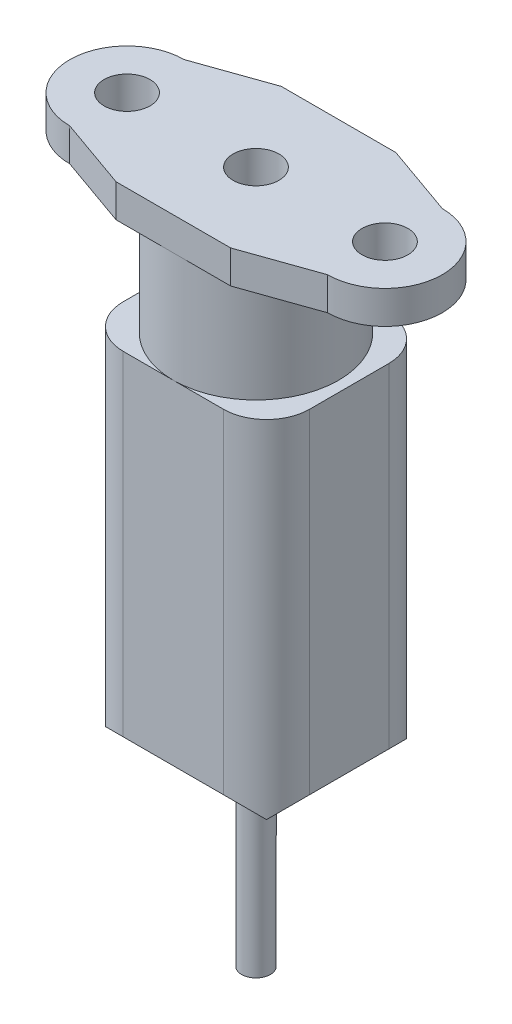
ISO-10303-21;
HEADER;
FILE_DESCRIPTION(('STEP AP214'),'2;1');
FILE_NAME('part.step','',(''),(''),'','','');
FILE_SCHEMA(('AUTOMOTIVE_DESIGN { 1 0 10303 214 1 1 1 1 }'));
ENDSEC;
DATA;
#1=APPLICATION_CONTEXT('core data for automotive mechanical design processes');
#2=APPLICATION_PROTOCOL_DEFINITION('international standard','automotive_design',2000,#1);
#3=PRODUCT_CONTEXT('',#1,'mechanical');
#4=PRODUCT('Part','Part','',(#3));
#5=PRODUCT_RELATED_PRODUCT_CATEGORY('part','',(#4));
#6=PRODUCT_DEFINITION_FORMATION('','',#4);
#7=PRODUCT_DEFINITION_CONTEXT('part definition',#1,'design');
#8=PRODUCT_DEFINITION('design','',#6,#7);
#9=PRODUCT_DEFINITION_SHAPE('','',#8);
#10=(LENGTH_UNIT() NAMED_UNIT(*) SI_UNIT(.MILLI.,.METRE.));
#11=(NAMED_UNIT(*) PLANE_ANGLE_UNIT() SI_UNIT($,.RADIAN.));
#12=(NAMED_UNIT(*) SI_UNIT($,.STERADIAN.) SOLID_ANGLE_UNIT());
#13=UNCERTAINTY_MEASURE_WITH_UNIT(LENGTH_MEASURE(1.E-05),#10,'distance_accuracy_value','');
#14=(GEOMETRIC_REPRESENTATION_CONTEXT(3) GLOBAL_UNCERTAINTY_ASSIGNED_CONTEXT((#13)) GLOBAL_UNIT_ASSIGNED_CONTEXT((#10,
#11,#12)) REPRESENTATION_CONTEXT('',''));
#15=CARTESIAN_POINT('',(0.,0.,0.));
#16=DIRECTION('',(0.,0.,1.));
#17=DIRECTION('',(1.,0.,0.));
#18=AXIS2_PLACEMENT_3D('',#15,#16,#17);
#19=CARTESIAN_POINT('',(-62.6999985985458,-2.3,-14.9999996647239));
#20=DIRECTION('',(0.,-1.,0.));
#21=DIRECTION('',(0.,0.,-1.));
#22=AXIS2_PLACEMENT_3D('',#19,#20,#21);
#23=PLANE('',#22);
#24=CARTESIAN_POINT('',(-71.6999985985458,-2.3,-14.9999996647239));
#25=DIRECTION('',(0.,-1.,0.));
#26=DIRECTION('',(0.,0.,-1.));
#27=AXIS2_PLACEMENT_3D('',#24,#25,#26);
#28=CIRCLE('',#27,5.765);
#29=CARTESIAN_POINT('',(-71.6999985985458,-2.3,-20.7649996647239));
#30=VERTEX_POINT('',#29);
#31=CARTESIAN_POINT('',(-71.6999985985458,-2.3,-9.23499966472387));
#32=VERTEX_POINT('',#31);
#33=EDGE_CURVE('E211',#30,#32,#28,.T.);
#34=ORIENTED_EDGE('',*,*,#33,.F.);
#35=DIRECTION('',(1.,0.,0.));
#36=VECTOR('',#35,1.);
#37=CARTESIAN_POINT('',(-75.6999985985458,-2.3,-20.7649996647239));
#38=LINE('',#37,#36);
#39=CARTESIAN_POINT('',(-67.6999985985458,-2.3,-20.7649996647239));
#40=VERTEX_POINT('',#39);
#41=EDGE_CURVE('E271',#30,#40,#38,.T.);
#42=ORIENTED_EDGE('',*,*,#41,.T.);
#43=DIRECTION('',(0.942972923561985,0.,0.332869442017381));
#44=VECTOR('',#43,1.);
#45=CARTESIAN_POINT('',(-67.6999985985458,-2.3,-20.7649996647239));
#46=LINE('',#45,#44);
#47=CARTESIAN_POINT('',(-62.6999985985458,-2.3,-18.9999996647239));
#48=VERTEX_POINT('',#47);
#49=EDGE_CURVE('E274',#40,#48,#46,.T.);
#50=ORIENTED_EDGE('',*,*,#49,.T.);
#51=CARTESIAN_POINT('',(-62.6999985985458,-2.3,-14.9999996647239));
#52=DIRECTION('',(0.,-1.,0.));
#53=DIRECTION('',(0.,0.,-1.));
#54=AXIS2_PLACEMENT_3D('',#51,#52,#53);
#55=CIRCLE('',#54,4.);
#56=CARTESIAN_POINT('',(-62.6999985985458,-2.3,-10.9999996647239));
#57=VERTEX_POINT('',#56);
#58=EDGE_CURVE('E277',#48,#57,#55,.T.);
#59=ORIENTED_EDGE('',*,*,#58,.T.);
#60=DIRECTION('',(-0.942972923561984,0.,0.332869442017384));
#61=VECTOR('',#60,1.);
#62=CARTESIAN_POINT('',(-62.6999985985458,-2.3,-10.9999996647239));
#63=LINE('',#62,#61);
#64=CARTESIAN_POINT('',(-67.6999985985458,-2.3,-9.23499966472388));
#65=VERTEX_POINT('',#64);
#66=EDGE_CURVE('E280',#57,#65,#63,.T.);
#67=ORIENTED_EDGE('',*,*,#66,.T.);
#68=DIRECTION('',(-1.,0.,0.));
#69=VECTOR('',#68,1.);
#70=CARTESIAN_POINT('',(-67.6999985985458,-2.3,-9.23499966472388));
#71=LINE('',#70,#69);
#72=EDGE_CURVE('E284',#65,#32,#71,.T.);
#73=ORIENTED_EDGE('',*,*,#72,.T.);
#74=EDGE_LOOP('',(#34,#42,#50,#59,#67,#73));
#75=FACE_BOUND('',#74,.T.);
#76=CARTESIAN_POINT('',(-62.6999985985458,-2.3,-14.9999996647239));
#77=DIRECTION('',(0.,-1.,0.));
#78=DIRECTION('',(0.,0.,1.));
#79=AXIS2_PLACEMENT_3D('',#76,#77,#78);
#80=CIRCLE('',#79,1.6);
#81=CARTESIAN_POINT('',(-62.6999985985458,-2.3,-13.3999996647239));
#82=VERTEX_POINT('',#81);
#83=EDGE_CURVE('E234',#82,#82,#80,.T.);
#84=ORIENTED_EDGE('',*,*,#83,.F.);
#85=EDGE_LOOP('',(#84));
#86=FACE_BOUND('',#85,.T.);
#87=ADVANCED_FACE('F33',(#75,#86),#23,.T.);
#88=CARTESIAN_POINT('',(-80.6999985985458,0.,-18.9999996647239));
#89=DIRECTION('',(-0.332869442017381,0.,-0.942972923561985));
#90=DIRECTION('',(-0.942972923561985,0.,0.332869442017381));
#91=AXIS2_PLACEMENT_3D('',#88,#89,#90);
#92=PLANE('',#91);
#93=DIRECTION('',(0.942972923561985,0.,-0.332869442017381));
#94=VECTOR('',#93,1.);
#95=CARTESIAN_POINT('',(-80.6999985985458,-2.3,-18.9999996647239));
#96=LINE('',#95,#94);
#97=CARTESIAN_POINT('',(-80.6999985985458,-2.3,-18.9999996647239));
#98=VERTEX_POINT('',#97);
#99=CARTESIAN_POINT('',(-75.6999985985458,-2.3,-20.7649996647239));
#100=VERTEX_POINT('',#99);
#101=EDGE_CURVE('E240',#98,#100,#96,.T.);
#102=ORIENTED_EDGE('',*,*,#101,.F.);
#103=DIRECTION('',(0.,-1.,0.));
#104=VECTOR('',#103,1.);
#105=CARTESIAN_POINT('',(-80.6999985985458,0.,-18.9999996647239));
#106=LINE('',#105,#104);
#107=CARTESIAN_POINT('',(-80.6999985985458,0.,-18.9999996647239));
#108=VERTEX_POINT('',#107);
#109=EDGE_CURVE('E292',#108,#98,#106,.T.);
#110=ORIENTED_EDGE('',*,*,#109,.F.);
#111=DIRECTION('',(0.942972923561985,0.,-0.332869442017381));
#112=VECTOR('',#111,1.);
#113=CARTESIAN_POINT('',(-80.6999985985458,0.,-18.9999996647239));
#114=LINE('',#113,#112);
#115=CARTESIAN_POINT('',(-75.6999985985458,0.,-20.7649996647239));
#116=VERTEX_POINT('',#115);
#117=EDGE_CURVE('E243',#108,#116,#114,.T.);
#118=ORIENTED_EDGE('',*,*,#117,.T.);
#119=DIRECTION('',(0.,-1.,0.));
#120=VECTOR('',#119,1.);
#121=CARTESIAN_POINT('',(-75.6999985985458,0.,-20.7649996647239));
#122=LINE('',#121,#120);
#123=EDGE_CURVE('E268',#116,#100,#122,.T.);
#124=ORIENTED_EDGE('',*,*,#123,.T.);
#125=EDGE_LOOP('',(#102,#110,#118,#124));
#126=FACE_BOUND('',#125,.T.);
#127=ADVANCED_FACE('F435',(#126),#92,.T.);
#128=CARTESIAN_POINT('',(-80.6999985985458,0.,-14.9999996647239));
#129=DIRECTION('',(0.,-1.,0.));
#130=DIRECTION('',(0.,0.,-1.));
#131=AXIS2_PLACEMENT_3D('',#128,#129,#130);
#132=CYLINDRICAL_SURFACE('',#131,4.00000000000001);
#133=CARTESIAN_POINT('',(-80.6999985985458,-2.3,-14.9999996647239));
#134=DIRECTION('',(0.,-1.,0.));
#135=DIRECTION('',(0.,0.,-1.));
#136=AXIS2_PLACEMENT_3D('',#133,#134,#135);
#137=CIRCLE('',#136,4.00000000000001);
#138=CARTESIAN_POINT('',(-80.6999985985458,-2.3,-10.9999996647239));
#139=VERTEX_POINT('',#138);
#140=EDGE_CURVE('E247',#139,#98,#137,.T.);
#141=ORIENTED_EDGE('',*,*,#140,.F.);
#142=DIRECTION('',(0.,-1.,0.));
#143=VECTOR('',#142,1.);
#144=CARTESIAN_POINT('',(-80.6999985985458,0.,-10.9999996647239));
#145=LINE('',#144,#143);
#146=CARTESIAN_POINT('',(-80.6999985985458,0.,-10.9999996647239));
#147=VERTEX_POINT('',#146);
#148=EDGE_CURVE('E294',#147,#139,#145,.T.);
#149=ORIENTED_EDGE('',*,*,#148,.F.);
#150=CARTESIAN_POINT('',(-80.6999985985458,0.,-14.9999996647239));
#151=DIRECTION('',(0.,-1.,0.));
#152=DIRECTION('',(0.,0.,-1.));
#153=AXIS2_PLACEMENT_3D('',#150,#151,#152);
#154=CIRCLE('',#153,4.00000000000001);
#155=EDGE_CURVE('E265',#147,#108,#154,.T.);
#156=ORIENTED_EDGE('',*,*,#155,.T.);
#157=ORIENTED_EDGE('',*,*,#109,.T.);
#158=EDGE_LOOP('',(#141,#149,#156,#157));
#159=FACE_BOUND('',#158,.T.);
#160=ADVANCED_FACE('F442',(#159),#132,.T.);
#161=CARTESIAN_POINT('',(-75.6999985985458,0.,-9.23499966472387));
#162=DIRECTION('',(-0.332869442017383,0.,0.942972923561984));
#163=DIRECTION('',(0.942972923561984,0.,0.332869442017383));
#164=AXIS2_PLACEMENT_3D('',#161,#162,#163);
#165=PLANE('',#164);
#166=DIRECTION('',(-0.942972923561984,0.,-0.332869442017383));
#167=VECTOR('',#166,1.);
#168=CARTESIAN_POINT('',(-75.6999985985458,-2.3,-9.23499966472387));
#169=LINE('',#168,#167);
#170=CARTESIAN_POINT('',(-75.6999985985458,-2.3,-9.23499966472387));
#171=VERTEX_POINT('',#170);
#172=EDGE_CURVE('E287',#171,#139,#169,.T.);
#173=ORIENTED_EDGE('',*,*,#172,.F.);
#174=DIRECTION('',(0.,-1.,0.));
#175=VECTOR('',#174,1.);
#176=CARTESIAN_POINT('',(-75.6999985985458,0.,-9.23499966472387));
#177=LINE('',#176,#175);
#178=CARTESIAN_POINT('',(-75.6999985985458,0.,-9.23499966472387));
#179=VERTEX_POINT('',#178);
#180=EDGE_CURVE('E296',#179,#171,#177,.T.);
#181=ORIENTED_EDGE('',*,*,#180,.F.);
#182=DIRECTION('',(-0.942972923561984,0.,-0.332869442017383));
#183=VECTOR('',#182,1.);
#184=CARTESIAN_POINT('',(-75.6999985985458,0.,-9.23499966472387));
#185=LINE('',#184,#183);
#186=EDGE_CURVE('E262',#179,#147,#185,.T.);
#187=ORIENTED_EDGE('',*,*,#186,.T.);
#188=ORIENTED_EDGE('',*,*,#148,.T.);
#189=EDGE_LOOP('',(#173,#181,#187,#188));
#190=FACE_BOUND('',#189,.T.);
#191=ADVANCED_FACE('F633',(#190),#165,.T.);
#192=CARTESIAN_POINT('',(-67.6999985985458,0.,-9.23499966472388));
#193=DIRECTION('',(0.,0.,1.));
#194=DIRECTION('',(1.,0.,0.));
#195=AXIS2_PLACEMENT_3D('',#192,#193,#194);
#196=PLANE('',#195);
#197=ORIENTED_EDGE('',*,*,#72,.F.);
#198=DIRECTION('',(0.,-1.,0.));
#199=VECTOR('',#198,1.);
#200=CARTESIAN_POINT('',(-67.6999985985458,0.,-9.23499966472388));
#201=LINE('',#200,#199);
#202=CARTESIAN_POINT('',(-67.6999985985458,0.,-9.23499966472388));
#203=VERTEX_POINT('',#202);
#204=EDGE_CURVE('E299',#203,#65,#201,.T.);
#205=ORIENTED_EDGE('',*,*,#204,.F.);
#206=DIRECTION('',(-1.,0.,0.));
#207=VECTOR('',#206,1.);
#208=CARTESIAN_POINT('',(-67.6999985985458,0.,-9.23499966472388));
#209=LINE('',#208,#207);
#210=EDGE_CURVE('E259',#203,#179,#209,.T.);
#211=ORIENTED_EDGE('',*,*,#210,.T.);
#212=ORIENTED_EDGE('',*,*,#180,.T.);
#213=EDGE_CURVE('E283',#32,#171,#71,.T.);
#214=ORIENTED_EDGE('',*,*,#213,.F.);
#215=EDGE_LOOP('',(#197,#205,#211,#212,#214));
#216=FACE_BOUND('',#215,.T.);
#217=ADVANCED_FACE('F629',(#216),#196,.T.);
#218=CARTESIAN_POINT('',(-62.6999985985458,0.,-10.9999996647239));
#219=DIRECTION('',(0.332869442017384,0.,0.942972923561984));
#220=DIRECTION('',(0.942972923561984,0.,-0.332869442017384));
#221=AXIS2_PLACEMENT_3D('',#218,#219,#220);
#222=PLANE('',#221);
#223=ORIENTED_EDGE('',*,*,#66,.F.);
#224=DIRECTION('',(0.,-1.,0.));
#225=VECTOR('',#224,1.);
#226=CARTESIAN_POINT('',(-62.6999985985458,0.,-10.9999996647239));
#227=LINE('',#226,#225);
#228=CARTESIAN_POINT('',(-62.6999985985458,0.,-10.9999996647239));
#229=VERTEX_POINT('',#228);
#230=EDGE_CURVE('E301',#229,#57,#227,.T.);
#231=ORIENTED_EDGE('',*,*,#230,.F.);
#232=DIRECTION('',(-0.942972923561984,0.,0.332869442017384));
#233=VECTOR('',#232,1.);
#234=CARTESIAN_POINT('',(-62.6999985985458,0.,-10.9999996647239));
#235=LINE('',#234,#233);
#236=EDGE_CURVE('E256',#229,#203,#235,.T.);
#237=ORIENTED_EDGE('',*,*,#236,.T.);
#238=ORIENTED_EDGE('',*,*,#204,.T.);
#239=EDGE_LOOP('',(#223,#231,#237,#238));
#240=FACE_BOUND('',#239,.T.);
#241=ADVANCED_FACE('F625',(#240),#222,.T.);
#242=CARTESIAN_POINT('',(-62.6999985985458,0.,-14.9999996647239));
#243=DIRECTION('',(0.,-1.,0.));
#244=DIRECTION('',(0.,0.,-1.));
#245=AXIS2_PLACEMENT_3D('',#242,#243,#244);
#246=CYLINDRICAL_SURFACE('',#245,4.);
#247=ORIENTED_EDGE('',*,*,#58,.F.);
#248=DIRECTION('',(0.,-1.,0.));
#249=VECTOR('',#248,1.);
#250=CARTESIAN_POINT('',(-62.6999985985458,0.,-18.9999996647239));
#251=LINE('',#250,#249);
#252=CARTESIAN_POINT('',(-62.6999985985458,0.,-18.9999996647239));
#253=VERTEX_POINT('',#252);
#254=EDGE_CURVE('E303',#253,#48,#251,.T.);
#255=ORIENTED_EDGE('',*,*,#254,.F.);
#256=CARTESIAN_POINT('',(-62.6999985985458,0.,-14.9999996647239));
#257=DIRECTION('',(0.,-1.,0.));
#258=DIRECTION('',(0.,0.,-1.));
#259=AXIS2_PLACEMENT_3D('',#256,#257,#258);
#260=CIRCLE('',#259,4.);
#261=EDGE_CURVE('E253',#253,#229,#260,.T.);
#262=ORIENTED_EDGE('',*,*,#261,.T.);
#263=ORIENTED_EDGE('',*,*,#230,.T.);
#264=EDGE_LOOP('',(#247,#255,#262,#263));
#265=FACE_BOUND('',#264,.T.);
#266=ADVANCED_FACE('F621',(#265),#246,.T.);
#267=CARTESIAN_POINT('',(-67.6999985985458,0.,-20.7649996647239));
#268=DIRECTION('',(0.332869442017381,0.,-0.942972923561985));
#269=DIRECTION('',(-0.942972923561985,0.,-0.332869442017381));
#270=AXIS2_PLACEMENT_3D('',#267,#268,#269);
#271=PLANE('',#270);
#272=ORIENTED_EDGE('',*,*,#49,.F.);
#273=DIRECTION('',(0.,-1.,0.));
#274=VECTOR('',#273,1.);
#275=CARTESIAN_POINT('',(-67.6999985985458,0.,-20.7649996647239));
#276=LINE('',#275,#274);
#277=CARTESIAN_POINT('',(-67.6999985985458,0.,-20.7649996647239));
#278=VERTEX_POINT('',#277);
#279=EDGE_CURVE('E305',#278,#40,#276,.T.);
#280=ORIENTED_EDGE('',*,*,#279,.F.);
#281=DIRECTION('',(0.942972923561985,0.,0.332869442017381));
#282=VECTOR('',#281,1.);
#283=CARTESIAN_POINT('',(-67.6999985985458,0.,-20.7649996647239));
#284=LINE('',#283,#282);
#285=EDGE_CURVE('E250',#278,#253,#284,.T.);
#286=ORIENTED_EDGE('',*,*,#285,.T.);
#287=ORIENTED_EDGE('',*,*,#254,.T.);
#288=EDGE_LOOP('',(#272,#280,#286,#287));
#289=FACE_BOUND('',#288,.T.);
#290=ADVANCED_FACE('F617',(#289),#271,.T.);
#291=CARTESIAN_POINT('',(-75.6999985985458,0.,-20.7649996647239));
#292=DIRECTION('',(0.,0.,-1.));
#293=DIRECTION('',(-1.,0.,0.));
#294=AXIS2_PLACEMENT_3D('',#291,#292,#293);
#295=PLANE('',#294);
#296=EDGE_CURVE('E272',#100,#30,#38,.T.);
#297=ORIENTED_EDGE('',*,*,#296,.F.);
#298=ORIENTED_EDGE('',*,*,#123,.F.);
#299=DIRECTION('',(1.,0.,0.));
#300=VECTOR('',#299,1.);
#301=CARTESIAN_POINT('',(-75.6999985985458,0.,-20.7649996647239));
#302=LINE('',#301,#300);
#303=EDGE_CURVE('E246',#116,#278,#302,.T.);
#304=ORIENTED_EDGE('',*,*,#303,.T.);
#305=ORIENTED_EDGE('',*,*,#279,.T.);
#306=ORIENTED_EDGE('',*,*,#41,.F.);
#307=EDGE_LOOP('',(#297,#298,#304,#305,#306));
#308=FACE_BOUND('',#307,.T.);
#309=ADVANCED_FACE('F460',(#308),#295,.T.);
#310=CARTESIAN_POINT('',(-62.6999985985458,0.,-14.9999996647239));
#311=DIRECTION('',(0.,-1.,0.));
#312=DIRECTION('',(0.,0.,-1.));
#313=AXIS2_PLACEMENT_3D('',#310,#311,#312);
#314=PLANE('',#313);
#315=CARTESIAN_POINT('',(-80.6999985985458,0.,-14.9999996647239));
#316=DIRECTION('',(0.,-1.,0.));
#317=DIRECTION('',(0.,0.,1.));
#318=AXIS2_PLACEMENT_3D('',#315,#316,#317);
#319=CIRCLE('',#318,1.6);
#320=CARTESIAN_POINT('',(-80.6999985985458,0.,-13.3999996647239));
#321=VERTEX_POINT('',#320);
#322=EDGE_CURVE('E225',#321,#321,#319,.T.);
#323=ORIENTED_EDGE('',*,*,#322,.T.);
#324=EDGE_LOOP('',(#323));
#325=FACE_BOUND('',#324,.T.);
#326=CARTESIAN_POINT('',(-71.6999985985458,0.,-14.9999996647239));
#327=DIRECTION('',(0.,-1.,0.));
#328=DIRECTION('',(0.,0.,1.));
#329=AXIS2_PLACEMENT_3D('',#326,#327,#328);
#330=CIRCLE('',#329,1.6);
#331=CARTESIAN_POINT('',(-71.6999985985458,0.,-13.3999996647239));
#332=VERTEX_POINT('',#331);
#333=EDGE_CURVE('E228',#332,#332,#330,.T.);
#334=ORIENTED_EDGE('',*,*,#333,.T.);
#335=EDGE_LOOP('',(#334));
#336=FACE_BOUND('',#335,.T.);
#337=CARTESIAN_POINT('',(-62.6999985985458,0.,-14.9999996647239));
#338=DIRECTION('',(0.,-1.,0.));
#339=DIRECTION('',(0.,0.,1.));
#340=AXIS2_PLACEMENT_3D('',#337,#338,#339);
#341=CIRCLE('',#340,1.6);
#342=CARTESIAN_POINT('',(-62.6999985985458,0.,-13.3999996647239));
#343=VERTEX_POINT('',#342);
#344=EDGE_CURVE('E237',#343,#343,#341,.T.);
#345=ORIENTED_EDGE('',*,*,#344,.T.);
#346=EDGE_LOOP('',(#345));
#347=FACE_BOUND('',#346,.T.);
#348=ORIENTED_EDGE('',*,*,#117,.F.);
#349=ORIENTED_EDGE('',*,*,#155,.F.);
#350=ORIENTED_EDGE('',*,*,#186,.F.);
#351=ORIENTED_EDGE('',*,*,#210,.F.);
#352=ORIENTED_EDGE('',*,*,#236,.F.);
#353=ORIENTED_EDGE('',*,*,#261,.F.);
#354=ORIENTED_EDGE('',*,*,#285,.F.);
#355=ORIENTED_EDGE('',*,*,#303,.F.);
#356=EDGE_LOOP('',(#348,#349,#350,#351,#352,#353,#354,#355));
#357=FACE_BOUND('',#356,.T.);
#358=ADVANCED_FACE('F451',(#325,#336,#347,#357),#314,.F.);
#359=EDGE_CURVE('E224',#32,#30,#28,.T.);
#360=ORIENTED_EDGE('',*,*,#359,.F.);
#361=ORIENTED_EDGE('',*,*,#213,.T.);
#362=ORIENTED_EDGE('',*,*,#172,.T.);
#363=ORIENTED_EDGE('',*,*,#140,.T.);
#364=ORIENTED_EDGE('',*,*,#101,.T.);
#365=ORIENTED_EDGE('',*,*,#296,.T.);
#366=EDGE_LOOP('',(#360,#361,#362,#363,#364,#365));
#367=FACE_BOUND('',#366,.T.);
#368=CARTESIAN_POINT('',(-80.6999985985458,-2.3,-14.9999996647239));
#369=DIRECTION('',(0.,-1.,0.));
#370=DIRECTION('',(0.,0.,1.));
#371=AXIS2_PLACEMENT_3D('',#368,#369,#370);
#372=CIRCLE('',#371,1.6);
#373=CARTESIAN_POINT('',(-80.6999985985458,-2.3,-13.3999996647239));
#374=VERTEX_POINT('',#373);
#375=EDGE_CURVE('E229',#374,#374,#372,.T.);
#376=ORIENTED_EDGE('',*,*,#375,.F.);
#377=EDGE_LOOP('',(#376));
#378=FACE_BOUND('',#377,.T.);
#379=ADVANCED_FACE('F438',(#367,#378),#23,.T.);
#380=CARTESIAN_POINT('',(-62.6999985985458,0.,-14.9999996647239));
#381=DIRECTION('',(0.,-1.,0.));
#382=DIRECTION('',(0.,0.,-1.));
#383=AXIS2_PLACEMENT_3D('',#380,#381,#382);
#384=CYLINDRICAL_SURFACE('',#383,1.6);
#385=ORIENTED_EDGE('',*,*,#344,.F.);
#386=EDGE_LOOP('',(#385));
#387=FACE_BOUND('',#386,.T.);
#388=ORIENTED_EDGE('',*,*,#83,.T.);
#389=EDGE_LOOP('',(#388));
#390=FACE_BOUND('',#389,.T.);
#391=ADVANCED_FACE('F450',(#387,#390),#384,.F.);
#392=CARTESIAN_POINT('',(-71.6999985985458,0.,-14.9999996647239));
#393=DIRECTION('',(0.,-1.,0.));
#394=DIRECTION('',(0.,0.,-1.));
#395=AXIS2_PLACEMENT_3D('',#392,#393,#394);
#396=CYLINDRICAL_SURFACE('',#395,1.6);
#397=ORIENTED_EDGE('',*,*,#333,.F.);
#398=EDGE_LOOP('',(#397));
#399=FACE_BOUND('',#398,.T.);
#400=CARTESIAN_POINT('',(-71.6999985985458,-2.3,-14.9999996647239));
#401=DIRECTION('',(0.,-1.,0.));
#402=DIRECTION('',(0.,0.,1.));
#403=AXIS2_PLACEMENT_3D('',#400,#401,#402);
#404=CIRCLE('',#403,1.6);
#405=CARTESIAN_POINT('',(-71.6999985985458,-2.3,-13.3999996647239));
#406=VERTEX_POINT('',#405);
#407=EDGE_CURVE('E206',#406,#406,#404,.T.);
#408=ORIENTED_EDGE('',*,*,#407,.T.);
#409=EDGE_LOOP('',(#408));
#410=FACE_BOUND('',#409,.T.);
#411=ADVANCED_FACE('F457',(#399,#410),#396,.F.);
#412=CARTESIAN_POINT('',(-80.6999985985458,0.,-14.9999996647239));
#413=DIRECTION('',(0.,-1.,0.));
#414=DIRECTION('',(0.,0.,-1.));
#415=AXIS2_PLACEMENT_3D('',#412,#413,#414);
#416=CYLINDRICAL_SURFACE('',#415,1.6);
#417=ORIENTED_EDGE('',*,*,#322,.F.);
#418=EDGE_LOOP('',(#417));
#419=FACE_BOUND('',#418,.T.);
#420=ORIENTED_EDGE('',*,*,#375,.T.);
#421=EDGE_LOOP('',(#420));
#422=FACE_BOUND('',#421,.T.);
#423=ADVANCED_FACE('F467',(#419,#422),#416,.F.);
#424=CARTESIAN_POINT('',(-71.6999985985458,-10.,-14.9999996647239));
#425=DIRECTION('',(0.,1.,0.));
#426=DIRECTION('',(0.,0.,1.));
#427=AXIS2_PLACEMENT_3D('',#424,#425,#426);
#428=CYLINDRICAL_SURFACE('',#427,5.765);
#429=CARTESIAN_POINT('',(-71.6999985985458,-10.,-14.9999996647239));
#430=DIRECTION('',(0.,-1.,0.));
#431=DIRECTION('',(0.,0.,-1.));
#432=AXIS2_PLACEMENT_3D('',#429,#430,#431);
#433=CIRCLE('',#432,5.765);
#434=CARTESIAN_POINT('',(-71.6999985985458,-10.,-20.7649996647239));
#435=VERTEX_POINT('',#434);
#436=CARTESIAN_POINT('',(-71.6999985985458,-10.,-9.23499966472387));
#437=VERTEX_POINT('',#436);
#438=EDGE_CURVE('E199',#435,#437,#433,.T.);
#439=ORIENTED_EDGE('',*,*,#438,.F.);
#440=EDGE_CURVE('E202',#437,#435,#433,.T.);
#441=ORIENTED_EDGE('',*,*,#440,.F.);
#442=EDGE_LOOP('',(#439,#441));
#443=FACE_BOUND('',#442,.T.);
#444=ORIENTED_EDGE('',*,*,#33,.T.);
#445=ORIENTED_EDGE('',*,*,#359,.T.);
#446=EDGE_LOOP('',(#444,#445));
#447=FACE_BOUND('',#446,.T.);
#448=ADVANCED_FACE('F200',(#443,#447),#428,.T.);
#449=CARTESIAN_POINT('',(-71.6999985985458,-2.3,-14.9999996647239));
#450=DIRECTION('',(0.,-1.,0.));
#451=DIRECTION('',(0.,0.,-1.));
#452=AXIS2_PLACEMENT_3D('',#449,#450,#451);
#453=PLANE('',#452);
#454=ORIENTED_EDGE('',*,*,#407,.F.);
#455=EDGE_LOOP('',(#454));
#456=FACE_BOUND('',#455,.T.);
#457=ADVANCED_FACE('F475',(#456),#453,.F.);
#458=CARTESIAN_POINT('',(0.,-10.,0.));
#459=DIRECTION('',(0.,1.,0.));
#460=DIRECTION('',(0.,0.,1.));
#461=AXIS2_PLACEMENT_3D('',#458,#459,#460);
#462=PLANE('',#461);
#463=DIRECTION('',(-1.,0.,0.));
#464=VECTOR('',#463,1.);
#465=CARTESIAN_POINT('',(-78.1999985985458,-10.,-9.23499966472387));
#466=LINE('',#465,#464);
#467=CARTESIAN_POINT('',(-68.1999985985458,-10.,-9.23499966472387));
#468=VERTEX_POINT('',#467);
#469=EDGE_CURVE('E217',#468,#437,#466,.T.);
#470=ORIENTED_EDGE('',*,*,#469,.F.);
#471=CARTESIAN_POINT('',(-68.1999985985458,-10.,-12.2349996647239));
#472=DIRECTION('',(0.,1.,0.));
#473=DIRECTION('',(0.,0.,1.));
#474=AXIS2_PLACEMENT_3D('',#471,#472,#473);
#475=CIRCLE('',#474,3.);
#476=CARTESIAN_POINT('',(-65.1999985985458,-10.,-12.2349996647239));
#477=VERTEX_POINT('',#476);
#478=EDGE_CURVE('E373',#468,#477,#475,.T.);
#479=ORIENTED_EDGE('',*,*,#478,.T.);
#480=DIRECTION('',(0.,0.,1.));
#481=VECTOR('',#480,1.);
#482=CARTESIAN_POINT('',(-65.1999985985458,-10.,-9.23499966472387));
#483=LINE('',#482,#481);
#484=CARTESIAN_POINT('',(-65.1999985985458,-10.,-17.7649996647239));
#485=VERTEX_POINT('',#484);
#486=EDGE_CURVE('E194',#485,#477,#483,.T.);
#487=ORIENTED_EDGE('',*,*,#486,.F.);
#488=CARTESIAN_POINT('',(-68.1999985985458,-10.,-17.7649996647239));
#489=DIRECTION('',(0.,1.,0.));
#490=DIRECTION('',(0.,0.,1.));
#491=AXIS2_PLACEMENT_3D('',#488,#489,#490);
#492=CIRCLE('',#491,3.);
#493=CARTESIAN_POINT('',(-68.1999985985458,-10.,-20.7649996647239));
#494=VERTEX_POINT('',#493);
#495=EDGE_CURVE('E214',#485,#494,#492,.T.);
#496=ORIENTED_EDGE('',*,*,#495,.T.);
#497=DIRECTION('',(1.,0.,0.));
#498=VECTOR('',#497,1.);
#499=CARTESIAN_POINT('',(-65.1999985985458,-10.,-20.7649996647239));
#500=LINE('',#499,#498);
#501=EDGE_CURVE('E188',#435,#494,#500,.T.);
#502=ORIENTED_EDGE('',*,*,#501,.F.);
#503=ORIENTED_EDGE('',*,*,#438,.T.);
#504=EDGE_LOOP('',(#470,#479,#487,#496,#502,#503));
#505=FACE_BOUND('',#504,.T.);
#506=ADVANCED_FACE('F212',(#505),#462,.T.);
#507=CARTESIAN_POINT('',(-78.1999985985458,-36.3,-9.23499966472387));
#508=DIRECTION('',(0.,0.,-1.));
#509=DIRECTION('',(-1.,0.,0.));
#510=AXIS2_PLACEMENT_3D('',#507,#508,#509);
#511=PLANE('',#510);
#512=CARTESIAN_POINT('',(-75.1999985985458,-10.,-9.23499966472387));
#513=VERTEX_POINT('',#512);
#514=EDGE_CURVE('E210',#437,#513,#466,.T.);
#515=ORIENTED_EDGE('',*,*,#514,.T.);
#516=DIRECTION('',(0.,1.,0.));
#517=VECTOR('',#516,1.);
#518=CARTESIAN_POINT('',(-75.1999985985458,-36.3,-9.23499966472387));
#519=LINE('',#518,#517);
#520=CARTESIAN_POINT('',(-75.1999985985458,-33.3,-9.23499966472387));
#521=VERTEX_POINT('',#520);
#522=EDGE_CURVE('E366',#513,#521,#519,.F.);
#523=ORIENTED_EDGE('',*,*,#522,.T.);
#524=DIRECTION('',(1.,0.,0.));
#525=VECTOR('',#524,1.);
#526=CARTESIAN_POINT('',(-78.1999985985458,-33.3,-9.23499966472387));
#527=LINE('',#526,#525);
#528=CARTESIAN_POINT('',(-68.1999985985458,-33.3,-9.23499966472387));
#529=VERTEX_POINT('',#528);
#530=EDGE_CURVE('E325',#521,#529,#527,.T.);
#531=ORIENTED_EDGE('',*,*,#530,.T.);
#532=DIRECTION('',(0.,1.,0.));
#533=VECTOR('',#532,1.);
#534=CARTESIAN_POINT('',(-68.1999985985458,-36.3,-9.23499966472387));
#535=LINE('',#534,#533);
#536=EDGE_CURVE('E363',#529,#468,#535,.T.);
#537=ORIENTED_EDGE('',*,*,#536,.T.);
#538=ORIENTED_EDGE('',*,*,#469,.T.);
#539=EDGE_LOOP('',(#515,#523,#531,#537,#538));
#540=FACE_BOUND('',#539,.T.);
#541=ADVANCED_FACE('F387',(#540),#511,.F.);
#542=CARTESIAN_POINT('',(-78.1999985985458,-36.3,-20.7649996647239));
#543=DIRECTION('',(1.,0.,0.));
#544=DIRECTION('',(0.,0.,-1.));
#545=AXIS2_PLACEMENT_3D('',#542,#543,#544);
#546=PLANE('',#545);
#547=DIRECTION('',(0.,0.,-1.));
#548=VECTOR('',#547,1.);
#549=CARTESIAN_POINT('',(-78.1999985985458,-10.,-20.7649996647239));
#550=LINE('',#549,#548);
#551=CARTESIAN_POINT('',(-78.1999985985458,-10.,-12.2349996647239));
#552=VERTEX_POINT('',#551);
#553=CARTESIAN_POINT('',(-78.1999985985458,-10.,-17.7649996647239));
#554=VERTEX_POINT('',#553);
#555=EDGE_CURVE('E215',#552,#554,#550,.T.);
#556=ORIENTED_EDGE('',*,*,#555,.T.);
#557=DIRECTION('',(0.,1.,0.));
#558=VECTOR('',#557,1.);
#559=CARTESIAN_POINT('',(-78.1999985985458,-36.3,-17.7649996647239));
#560=LINE('',#559,#558);
#561=CARTESIAN_POINT('',(-78.1999985985458,-33.3,-17.7649996647239));
#562=VERTEX_POINT('',#561);
#563=EDGE_CURVE('E353',#554,#562,#560,.F.);
#564=ORIENTED_EDGE('',*,*,#563,.T.);
#565=DIRECTION('',(0.,0.,1.));
#566=VECTOR('',#565,1.);
#567=CARTESIAN_POINT('',(-78.1999985985458,-33.3,-20.7649996647239));
#568=LINE('',#567,#566);
#569=CARTESIAN_POINT('',(-78.1999985985458,-33.3,-12.2349996647239));
#570=VERTEX_POINT('',#569);
#571=EDGE_CURVE('E322',#562,#570,#568,.T.);
#572=ORIENTED_EDGE('',*,*,#571,.T.);
#573=DIRECTION('',(0.,1.,0.));
#574=VECTOR('',#573,1.);
#575=CARTESIAN_POINT('',(-78.1999985985458,-36.3,-12.2349996647239));
#576=LINE('',#575,#574);
#577=EDGE_CURVE('E350',#570,#552,#576,.T.);
#578=ORIENTED_EDGE('',*,*,#577,.T.);
#579=EDGE_LOOP('',(#556,#564,#572,#578));
#580=FACE_BOUND('',#579,.T.);
#581=ADVANCED_FACE('F404',(#580),#546,.F.);
#582=CARTESIAN_POINT('',(-65.1999985985458,-36.3,-20.7649996647239));
#583=DIRECTION('',(0.,0.,1.));
#584=DIRECTION('',(1.,0.,0.));
#585=AXIS2_PLACEMENT_3D('',#582,#583,#584);
#586=PLANE('',#585);
#587=DIRECTION('',(-1.,0.,0.));
#588=VECTOR('',#587,1.);
#589=CARTESIAN_POINT('',(-65.1999985985458,-33.3,-20.7649996647239));
#590=LINE('',#589,#588);
#591=CARTESIAN_POINT('',(-68.1999985985458,-33.3,-20.7649996647239));
#592=VERTEX_POINT('',#591);
#593=CARTESIAN_POINT('',(-75.1999985985458,-33.3,-20.7649996647239));
#594=VERTEX_POINT('',#593);
#595=EDGE_CURVE('E328',#592,#594,#590,.T.);
#596=ORIENTED_EDGE('',*,*,#595,.T.);
#597=DIRECTION('',(0.,1.,0.));
#598=VECTOR('',#597,1.);
#599=CARTESIAN_POINT('',(-75.1999985985458,-36.3,-20.7649996647239));
#600=LINE('',#599,#598);
#601=CARTESIAN_POINT('',(-75.1999985985458,-10.,-20.7649996647239));
#602=VERTEX_POINT('',#601);
#603=EDGE_CURVE('E191',#594,#602,#600,.T.);
#604=ORIENTED_EDGE('',*,*,#603,.T.);
#605=EDGE_CURVE('E183',#602,#435,#500,.T.);
#606=ORIENTED_EDGE('',*,*,#605,.T.);
#607=ORIENTED_EDGE('',*,*,#501,.T.);
#608=DIRECTION('',(0.,1.,0.));
#609=VECTOR('',#608,1.);
#610=CARTESIAN_POINT('',(-68.1999985985458,-36.3,-20.7649996647239));
#611=LINE('',#610,#609);
#612=EDGE_CURVE('E332',#494,#592,#611,.F.);
#613=ORIENTED_EDGE('',*,*,#612,.T.);
#614=EDGE_LOOP('',(#596,#604,#606,#607,#613));
#615=FACE_BOUND('',#614,.T.);
#616=ADVANCED_FACE('F186',(#615),#586,.F.);
#617=CARTESIAN_POINT('',(-65.1999985985458,-36.3,-9.23499966472387));
#618=DIRECTION('',(-1.,0.,0.));
#619=DIRECTION('',(0.,0.,1.));
#620=AXIS2_PLACEMENT_3D('',#617,#618,#619);
#621=PLANE('',#620);
#622=ORIENTED_EDGE('',*,*,#486,.T.);
#623=DIRECTION('',(0.,1.,0.));
#624=VECTOR('',#623,1.);
#625=CARTESIAN_POINT('',(-65.1999985985458,-36.3,-12.2349996647239));
#626=LINE('',#625,#624);
#627=CARTESIAN_POINT('',(-65.1999985985458,-33.3,-12.2349996647239));
#628=VERTEX_POINT('',#627);
#629=EDGE_CURVE('E54',#477,#628,#626,.F.);
#630=ORIENTED_EDGE('',*,*,#629,.T.);
#631=DIRECTION('',(0.,0.,-1.));
#632=VECTOR('',#631,1.);
#633=CARTESIAN_POINT('',(-65.1999985985458,-33.3,-9.23499966472387));
#634=LINE('',#633,#632);
#635=CARTESIAN_POINT('',(-65.1999985985458,-33.3,-17.7649996647239));
#636=VERTEX_POINT('',#635);
#637=EDGE_CURVE('E330',#628,#636,#634,.T.);
#638=ORIENTED_EDGE('',*,*,#637,.T.);
#639=DIRECTION('',(0.,1.,0.));
#640=VECTOR('',#639,1.);
#641=CARTESIAN_POINT('',(-65.1999985985458,-36.3,-17.7649996647239));
#642=LINE('',#641,#640);
#643=EDGE_CURVE('E375',#636,#485,#642,.T.);
#644=ORIENTED_EDGE('',*,*,#643,.T.);
#645=EDGE_LOOP('',(#622,#630,#638,#644));
#646=FACE_BOUND('',#645,.T.);
#647=ADVANCED_FACE('F379',(#646),#621,.F.);
#648=CARTESIAN_POINT('',(0.,-36.3,0.));
#649=DIRECTION('',(0.,1.,0.));
#650=DIRECTION('',(0.,0.,1.));
#651=AXIS2_PLACEMENT_3D('',#648,#649,#650);
#652=PLANE('',#651);
#653=DIRECTION('',(-1.,0.,0.));
#654=VECTOR('',#653,1.);
#655=CARTESIAN_POINT('',(0.,-36.3,-12.2349996647238));
#656=LINE('',#655,#654);
#657=CARTESIAN_POINT('',(-68.1999985985458,-36.3,-12.2349996647238));
#658=VERTEX_POINT('',#657);
#659=CARTESIAN_POINT('',(-75.1999985985458,-36.3,-12.2349996647238));
#660=VERTEX_POINT('',#659);
#661=EDGE_CURVE('E317',#658,#660,#656,.T.);
#662=ORIENTED_EDGE('',*,*,#661,.T.);
#663=DIRECTION('',(0.,0.,-1.));
#664=VECTOR('',#663,1.);
#665=CARTESIAN_POINT('',(-75.1999985985458,-36.3,0.));
#666=LINE('',#665,#664);
#667=CARTESIAN_POINT('',(-75.1999985985458,-36.3,-17.7649996647239));
#668=VERTEX_POINT('',#667);
#669=EDGE_CURVE('E319',#660,#668,#666,.T.);
#670=ORIENTED_EDGE('',*,*,#669,.T.);
#671=DIRECTION('',(1.,0.,0.));
#672=VECTOR('',#671,1.);
#673=CARTESIAN_POINT('',(0.,-36.3,-17.7649996647239));
#674=LINE('',#673,#672);
#675=CARTESIAN_POINT('',(-68.1999985985458,-36.3,-17.7649996647239));
#676=VERTEX_POINT('',#675);
#677=EDGE_CURVE('E314',#668,#676,#674,.T.);
#678=ORIENTED_EDGE('',*,*,#677,.T.);
#679=DIRECTION('',(0.,0.,1.));
#680=VECTOR('',#679,1.);
#681=CARTESIAN_POINT('',(-68.1999985985458,-36.3,0.));
#682=LINE('',#681,#680);
#683=EDGE_CURVE('E312',#676,#658,#682,.T.);
#684=ORIENTED_EDGE('',*,*,#683,.T.);
#685=EDGE_LOOP('',(#662,#670,#678,#684));
#686=FACE_BOUND('',#685,.T.);
#687=CARTESIAN_POINT('',(-71.6999985985458,-36.3,-14.9999996647239));
#688=DIRECTION('',(0.,1.,0.));
#689=DIRECTION('',(0.,0.,1.));
#690=AXIS2_PLACEMENT_3D('',#687,#688,#689);
#691=CIRCLE('',#690,1.00000000000001);
#692=CARTESIAN_POINT('',(-71.6999985985458,-36.3,-13.9999996647239));
#693=VERTEX_POINT('',#692);
#694=EDGE_CURVE('E309',#693,#693,#691,.F.);
#695=ORIENTED_EDGE('',*,*,#694,.F.);
#696=EDGE_LOOP('',(#695));
#697=FACE_BOUND('',#696,.T.);
#698=ADVANCED_FACE('F417',(#686,#697),#652,.F.);
#699=ORIENTED_EDGE('',*,*,#605,.F.);
#700=CARTESIAN_POINT('',(-75.1999985985458,-10.,-17.7649996647239));
#701=DIRECTION('',(0.,1.,0.));
#702=DIRECTION('',(0.,0.,1.));
#703=AXIS2_PLACEMENT_3D('',#700,#701,#702);
#704=CIRCLE('',#703,3.);
#705=EDGE_CURVE('E348',#602,#554,#704,.T.);
#706=ORIENTED_EDGE('',*,*,#705,.T.);
#707=ORIENTED_EDGE('',*,*,#555,.F.);
#708=CARTESIAN_POINT('',(-75.1999985985458,-10.,-12.2349996647239));
#709=DIRECTION('',(0.,1.,0.));
#710=DIRECTION('',(0.,0.,1.));
#711=AXIS2_PLACEMENT_3D('',#708,#709,#710);
#712=CIRCLE('',#711,3.);
#713=EDGE_CURVE('E346',#552,#513,#712,.T.);
#714=ORIENTED_EDGE('',*,*,#713,.T.);
#715=ORIENTED_EDGE('',*,*,#514,.F.);
#716=ORIENTED_EDGE('',*,*,#440,.T.);
#717=EDGE_LOOP('',(#699,#706,#707,#714,#715,#716));
#718=FACE_BOUND('',#717,.T.);
#719=ADVANCED_FACE('F208',(#718),#462,.T.);
#720=CARTESIAN_POINT('',(-71.6999985985458,-48.3,-14.9999996647239));
#721=DIRECTION('',(0.,1.,0.));
#722=DIRECTION('',(0.,0.,1.));
#723=AXIS2_PLACEMENT_3D('',#720,#721,#722);
#724=CYLINDRICAL_SURFACE('',#723,1.00000000000001);
#725=CARTESIAN_POINT('',(-71.6999985985458,-48.3,-14.9999996647239));
#726=DIRECTION('',(0.,-1.,0.));
#727=DIRECTION('',(0.,0.,-1.));
#728=AXIS2_PLACEMENT_3D('',#725,#726,#727);
#729=CIRCLE('',#728,1.00000000000001);
#730=CARTESIAN_POINT('',(-71.6999985985458,-48.3,-15.9999996647239));
#731=VERTEX_POINT('',#730);
#732=EDGE_CURVE('E343',#731,#731,#729,.T.);
#733=ORIENTED_EDGE('',*,*,#732,.F.);
#734=EDGE_LOOP('',(#733));
#735=FACE_BOUND('',#734,.T.);
#736=ORIENTED_EDGE('',*,*,#694,.T.);
#737=EDGE_LOOP('',(#736));
#738=FACE_BOUND('',#737,.T.);
#739=ADVANCED_FACE('F430',(#735,#738),#724,.T.);
#740=CARTESIAN_POINT('',(-71.6999985985458,-48.3,-14.9999996647239));
#741=DIRECTION('',(0.,-1.,0.));
#742=DIRECTION('',(0.,0.,-1.));
#743=AXIS2_PLACEMENT_3D('',#740,#741,#742);
#744=PLANE('',#743);
#745=ORIENTED_EDGE('',*,*,#732,.T.);
#746=EDGE_LOOP('',(#745));
#747=FACE_BOUND('',#746,.T.);
#748=ADVANCED_FACE('F423',(#747),#744,.T.);
#749=CARTESIAN_POINT('',(-68.1999985985458,-36.3,0.));
#750=DIRECTION('',(-0.707106781186551,0.707106781186544,0.));
#751=DIRECTION('',(0.,0.,1.));
#752=AXIS2_PLACEMENT_3D('',#749,#750,#751);
#753=PLANE('',#752);
#754=ORIENTED_EDGE('',*,*,#637,.F.);
#755=CARTESIAN_POINT('',(-68.1999985985458,-36.3,-12.2349996647239));
#756=DIRECTION('',(-0.707106781186551,0.707106781186544,0.));
#757=DIRECTION('',(0.707106781186544,0.707106781186551,0.));
#758=AXIS2_PLACEMENT_3D('',#755,#756,#757);
#759=ELLIPSE('',#758,4.24264068711931,3.);
#760=CARTESIAN_POINT('',(-66.0786782549862,-34.1786796564404,-10.1136793211642));
#761=VERTEX_POINT('',#760);
#762=EDGE_CURVE('E11',#628,#761,#759,.F.);
#763=ORIENTED_EDGE('',*,*,#762,.T.);
#764=DIRECTION('',(-0.577350269189624,-0.577350269189629,-0.577350269189624));
#765=VECTOR('',#764,1.);
#766=CARTESIAN_POINT('',(-64.1216653769712,-32.2216667784254,-8.15666644314926));
#767=LINE('',#766,#765);
#768=EDGE_CURVE('E340',#658,#761,#767,.F.);
#769=ORIENTED_EDGE('',*,*,#768,.F.);
#770=ORIENTED_EDGE('',*,*,#683,.F.);
#771=DIRECTION('',(0.577350269189624,0.577350269189629,-0.577350269189624));
#772=VECTOR('',#771,1.);
#773=CARTESIAN_POINT('',(-74.1216651534537,-42.221666554908,-11.843333109816));
#774=LINE('',#773,#772);
#775=CARTESIAN_POINT('',(-66.0786782549862,-34.1786796564404,-19.8863200082836));
#776=VERTEX_POINT('',#775);
#777=EDGE_CURVE('E338',#776,#676,#774,.F.);
#778=ORIENTED_EDGE('',*,*,#777,.F.);
#779=CARTESIAN_POINT('',(-68.1999985985458,-36.3,-17.7649996647239));
#780=DIRECTION('',(-0.707106781186551,0.707106781186544,0.));
#781=DIRECTION('',(0.707106781186544,0.707106781186551,0.));
#782=AXIS2_PLACEMENT_3D('',#779,#780,#781);
#783=ELLIPSE('',#782,4.24264068711931,3.);
#784=EDGE_CURVE('E41',#776,#636,#783,.F.);
#785=ORIENTED_EDGE('',*,*,#784,.T.);
#786=EDGE_LOOP('',(#754,#763,#769,#770,#778,#785));
#787=FACE_BOUND('',#786,.T.);
#788=ADVANCED_FACE('F421',(#787),#753,.F.);
#789=CARTESIAN_POINT('',(0.,-36.3,-12.2349996647238));
#790=DIRECTION('',(0.,0.707106781186544,-0.707106781186551));
#791=DIRECTION('',(-1.,0.,0.));
#792=AXIS2_PLACEMENT_3D('',#789,#790,#791);
#793=PLANE('',#792);
#794=ORIENTED_EDGE('',*,*,#530,.F.);
#795=CARTESIAN_POINT('',(-75.1999985985458,-36.3,-12.2349996647239));
#796=DIRECTION('',(0.,0.707106781186544,-0.707106781186551));
#797=DIRECTION('',(0.,0.707106781186551,0.707106781186544));
#798=AXIS2_PLACEMENT_3D('',#795,#796,#797);
#799=ELLIPSE('',#798,4.24264068711931,3.);
#800=CARTESIAN_POINT('',(-77.3213189421054,-34.1786796564404,-10.1136793211642));
#801=VERTEX_POINT('',#800);
#802=EDGE_CURVE('E370',#521,#801,#799,.F.);
#803=ORIENTED_EDGE('',*,*,#802,.T.);
#804=DIRECTION('',(0.577350269189624,-0.577350269189629,-0.577350269189624));
#805=VECTOR('',#804,1.);
#806=CARTESIAN_POINT('',(-50.1333323990307,-61.3666661995154,-37.301665864239));
#807=LINE('',#806,#805);
#808=EDGE_CURVE('E335',#660,#801,#807,.F.);
#809=ORIENTED_EDGE('',*,*,#808,.F.);
#810=ORIENTED_EDGE('',*,*,#661,.F.);
#811=ORIENTED_EDGE('',*,*,#768,.T.);
#812=CARTESIAN_POINT('',(-68.1999985985458,-36.3,-12.2349996647239));
#813=DIRECTION('',(0.,0.707106781186544,-0.707106781186551));
#814=DIRECTION('',(0.,0.707106781186551,0.707106781186544));
#815=AXIS2_PLACEMENT_3D('',#812,#813,#814);
#816=ELLIPSE('',#815,4.24264068711931,3.);
#817=EDGE_CURVE('E368',#761,#529,#816,.F.);
#818=ORIENTED_EDGE('',*,*,#817,.T.);
#819=EDGE_LOOP('',(#794,#803,#809,#810,#811,#818));
#820=FACE_BOUND('',#819,.T.);
#821=ADVANCED_FACE('F392',(#820),#793,.F.);
#822=CARTESIAN_POINT('',(0.,-36.3,-17.7649996647239));
#823=DIRECTION('',(0.,0.707106781186544,0.707106781186551));
#824=DIRECTION('',(1.,0.,0.));
#825=AXIS2_PLACEMENT_3D('',#822,#823,#824);
#826=PLANE('',#825);
#827=DIRECTION('',(-0.577350269189624,0.577350269189629,-0.577350269189624));
#828=VECTOR('',#827,1.);
#829=CARTESIAN_POINT('',(-50.1333323990307,-61.3666661995154,7.30166653479119));
#830=LINE('',#829,#828);
#831=CARTESIAN_POINT('',(-77.3213189421054,-34.1786796564404,-19.8863200082835));
#832=VERTEX_POINT('',#831);
#833=EDGE_CURVE('E333',#832,#668,#830,.F.);
#834=ORIENTED_EDGE('',*,*,#833,.F.);
#835=CARTESIAN_POINT('',(-75.1999985985458,-36.3,-17.7649996647239));
#836=DIRECTION('',(0.,0.707106781186544,0.707106781186551));
#837=DIRECTION('',(0.,0.707106781186551,-0.707106781186544));
#838=AXIS2_PLACEMENT_3D('',#835,#836,#837);
#839=ELLIPSE('',#838,4.24264068711931,3.);
#840=EDGE_CURVE('E361',#832,#594,#839,.F.);
#841=ORIENTED_EDGE('',*,*,#840,.T.);
#842=ORIENTED_EDGE('',*,*,#595,.F.);
#843=CARTESIAN_POINT('',(-68.1999985985458,-36.3,-17.7649996647239));
#844=DIRECTION('',(0.,0.707106781186544,0.707106781186551));
#845=DIRECTION('',(0.,0.707106781186551,-0.707106781186544));
#846=AXIS2_PLACEMENT_3D('',#843,#844,#845);
#847=ELLIPSE('',#846,4.24264068711931,3.);
#848=EDGE_CURVE('E359',#592,#776,#847,.F.);
#849=ORIENTED_EDGE('',*,*,#848,.T.);
#850=ORIENTED_EDGE('',*,*,#777,.T.);
#851=ORIENTED_EDGE('',*,*,#677,.F.);
#852=EDGE_LOOP('',(#834,#841,#842,#849,#850,#851));
#853=FACE_BOUND('',#852,.T.);
#854=ADVANCED_FACE('F413',(#853),#826,.F.);
#855=CARTESIAN_POINT('',(-75.1999985985458,-36.3,0.));
#856=DIRECTION('',(0.707106781186551,0.707106781186544,0.));
#857=DIRECTION('',(0.,0.,-1.));
#858=AXIS2_PLACEMENT_3D('',#855,#856,#857);
#859=PLANE('',#858);
#860=ORIENTED_EDGE('',*,*,#571,.F.);
#861=CARTESIAN_POINT('',(-75.1999985985458,-36.3,-17.7649996647239));
#862=DIRECTION('',(0.707106781186551,0.707106781186544,0.));
#863=DIRECTION('',(-0.707106781186544,0.707106781186551,0.));
#864=AXIS2_PLACEMENT_3D('',#861,#862,#863);
#865=ELLIPSE('',#864,4.24264068711931,3.);
#866=EDGE_CURVE('E357',#562,#832,#865,.F.);
#867=ORIENTED_EDGE('',*,*,#866,.T.);
#868=ORIENTED_EDGE('',*,*,#833,.T.);
#869=ORIENTED_EDGE('',*,*,#669,.F.);
#870=ORIENTED_EDGE('',*,*,#808,.T.);
#871=CARTESIAN_POINT('',(-75.1999985985458,-36.3,-12.2349996647239));
#872=DIRECTION('',(0.707106781186551,0.707106781186544,0.));
#873=DIRECTION('',(-0.707106781186544,0.707106781186551,0.));
#874=AXIS2_PLACEMENT_3D('',#871,#872,#873);
#875=ELLIPSE('',#874,4.24264068711931,3.);
#876=EDGE_CURVE('E355',#801,#570,#875,.F.);
#877=ORIENTED_EDGE('',*,*,#876,.T.);
#878=EDGE_LOOP('',(#860,#867,#868,#869,#870,#877));
#879=FACE_BOUND('',#878,.T.);
#880=ADVANCED_FACE('F400',(#879),#859,.F.);
#881=CARTESIAN_POINT('',(-75.1999985985458,-36.3,-17.7649996647239));
#882=DIRECTION('',(0.,1.,0.));
#883=DIRECTION('',(0.,0.,1.));
#884=AXIS2_PLACEMENT_3D('',#881,#882,#883);
#885=CYLINDRICAL_SURFACE('',#884,3.);
#886=ORIENTED_EDGE('',*,*,#866,.F.);
#887=ORIENTED_EDGE('',*,*,#563,.F.);
#888=ORIENTED_EDGE('',*,*,#705,.F.);
#889=ORIENTED_EDGE('',*,*,#603,.F.);
#890=ORIENTED_EDGE('',*,*,#840,.F.);
#891=EDGE_LOOP('',(#886,#887,#888,#889,#890));
#892=FACE_BOUND('',#891,.T.);
#893=ADVANCED_FACE('F408',(#892),#885,.T.);
#894=CARTESIAN_POINT('',(-75.1999985985458,-36.3,-12.2349996647239));
#895=DIRECTION('',(0.,1.,0.));
#896=DIRECTION('',(0.,0.,1.));
#897=AXIS2_PLACEMENT_3D('',#894,#895,#896);
#898=CYLINDRICAL_SURFACE('',#897,3.);
#899=ORIENTED_EDGE('',*,*,#802,.F.);
#900=ORIENTED_EDGE('',*,*,#522,.F.);
#901=ORIENTED_EDGE('',*,*,#713,.F.);
#902=ORIENTED_EDGE('',*,*,#577,.F.);
#903=ORIENTED_EDGE('',*,*,#876,.F.);
#904=EDGE_LOOP('',(#899,#900,#901,#902,#903));
#905=FACE_BOUND('',#904,.T.);
#906=ADVANCED_FACE('F396',(#905),#898,.T.);
#907=CARTESIAN_POINT('',(-68.1999985985458,-36.3,-12.2349996647239));
#908=DIRECTION('',(0.,1.,0.));
#909=DIRECTION('',(0.,0.,1.));
#910=AXIS2_PLACEMENT_3D('',#907,#908,#909);
#911=CYLINDRICAL_SURFACE('',#910,3.);
#912=ORIENTED_EDGE('',*,*,#762,.F.);
#913=ORIENTED_EDGE('',*,*,#629,.F.);
#914=ORIENTED_EDGE('',*,*,#478,.F.);
#915=ORIENTED_EDGE('',*,*,#536,.F.);
#916=ORIENTED_EDGE('',*,*,#817,.F.);
#917=EDGE_LOOP('',(#912,#913,#914,#915,#916));
#918=FACE_BOUND('',#917,.T.);
#919=ADVANCED_FACE('F384',(#918),#911,.T.);
#920=CARTESIAN_POINT('',(-68.1999985985458,-36.3,-17.7649996647239));
#921=DIRECTION('',(0.,1.,0.));
#922=DIRECTION('',(0.,0.,1.));
#923=AXIS2_PLACEMENT_3D('',#920,#921,#922);
#924=CYLINDRICAL_SURFACE('',#923,3.);
#925=ORIENTED_EDGE('',*,*,#848,.F.);
#926=ORIENTED_EDGE('',*,*,#612,.F.);
#927=ORIENTED_EDGE('',*,*,#495,.F.);
#928=ORIENTED_EDGE('',*,*,#643,.F.);
#929=ORIENTED_EDGE('',*,*,#784,.F.);
#930=EDGE_LOOP('',(#925,#926,#927,#928,#929));
#931=FACE_BOUND('',#930,.T.);
#932=ADVANCED_FACE('F35',(#931),#924,.T.);
#933=CLOSED_SHELL('',(#87,#127,#160,#191,#217,#241,#266,#290,#309,#358,#379,#391,#411,#423,#448,
#457,#506,#541,#581,#616,#647,#698,#719,#739,#748,#788,#821,#854,#880,#893,#906,#919,#932));
#934=MANIFOLD_SOLID_BREP('B2',#933);
#935=ADVANCED_BREP_SHAPE_REPRESENTATION('',(#18,#934),#14);
#936=SHAPE_DEFINITION_REPRESENTATION(#9,#935);
ENDSEC;
END-ISO-10303-21;
